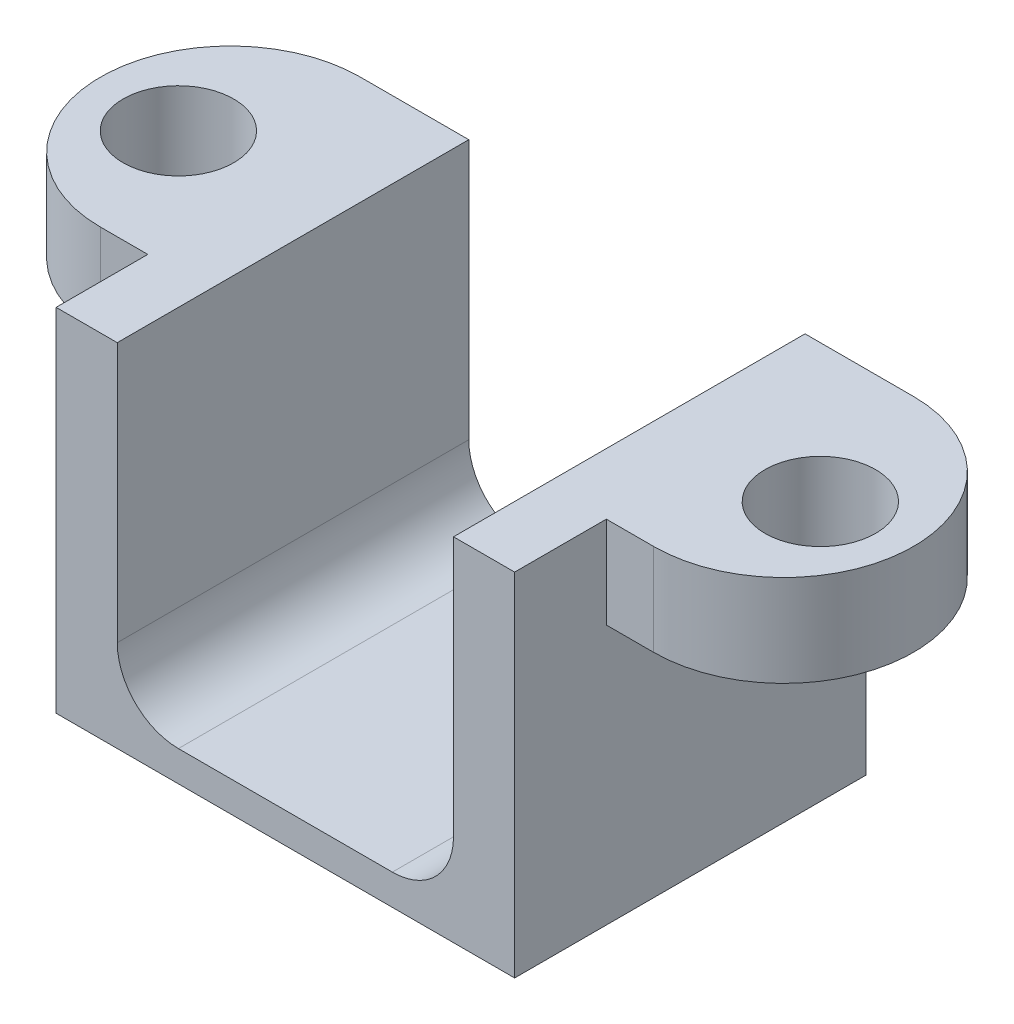
ISO-10303-21;
HEADER;
FILE_DESCRIPTION(('STEP AP214'),'2;1');
FILE_NAME('part.step','',(''),(''),'','','');
FILE_SCHEMA(('AUTOMOTIVE_DESIGN { 1 0 10303 214 1 1 1 1 }'));
ENDSEC;
DATA;
#1=APPLICATION_CONTEXT('core data for automotive mechanical design processes');
#2=APPLICATION_PROTOCOL_DEFINITION('international standard','automotive_design',2000,#1);
#3=PRODUCT_CONTEXT('',#1,'mechanical');
#4=PRODUCT('Part','Part','',(#3));
#5=PRODUCT_RELATED_PRODUCT_CATEGORY('part','',(#4));
#6=PRODUCT_DEFINITION_FORMATION('','',#4);
#7=PRODUCT_DEFINITION_CONTEXT('part definition',#1,'design');
#8=PRODUCT_DEFINITION('design','',#6,#7);
#9=PRODUCT_DEFINITION_SHAPE('','',#8);
#10=(LENGTH_UNIT() NAMED_UNIT(*) SI_UNIT(.MILLI.,.METRE.));
#11=(NAMED_UNIT(*) PLANE_ANGLE_UNIT() SI_UNIT($,.RADIAN.));
#12=(NAMED_UNIT(*) SI_UNIT($,.STERADIAN.) SOLID_ANGLE_UNIT());
#13=UNCERTAINTY_MEASURE_WITH_UNIT(LENGTH_MEASURE(1.E-05),#10,'distance_accuracy_value','');
#14=(GEOMETRIC_REPRESENTATION_CONTEXT(3) GLOBAL_UNCERTAINTY_ASSIGNED_CONTEXT((#13)) GLOBAL_UNIT_ASSIGNED_CONTEXT((#10,
#11,#12)) REPRESENTATION_CONTEXT('',''));
#15=CARTESIAN_POINT('',(0.,0.,0.));
#16=DIRECTION('',(0.,0.,1.));
#17=DIRECTION('',(1.,0.,0.));
#18=AXIS2_PLACEMENT_3D('',#15,#16,#17);
#19=CARTESIAN_POINT('',(0.,0.,11.5));
#20=DIRECTION('',(1.,0.,0.));
#21=DIRECTION('',(0.,0.,-1.));
#22=AXIS2_PLACEMENT_3D('',#19,#20,#21);
#23=PLANE('',#22);
#24=DIRECTION('',(0.,1.,0.));
#25=VECTOR('',#24,1.);
#26=CARTESIAN_POINT('',(0.,8.5,8.5));
#27=LINE('',#26,#25);
#28=CARTESIAN_POINT('',(0.,8.5,8.5));
#29=VERTEX_POINT('',#28);
#30=CARTESIAN_POINT('',(0.,11.5,8.5));
#31=VERTEX_POINT('',#30);
#32=EDGE_CURVE('E201',#29,#31,#27,.T.);
#33=ORIENTED_EDGE('',*,*,#32,.F.);
#34=DIRECTION('',(0.,0.,-1.));
#35=VECTOR('',#34,1.);
#36=CARTESIAN_POINT('',(0.,8.5,0.));
#37=LINE('',#36,#35);
#38=CARTESIAN_POINT('',(0.,8.5,0.));
#39=VERTEX_POINT('',#38);
#40=EDGE_CURVE('E186',#29,#39,#37,.T.);
#41=ORIENTED_EDGE('',*,*,#40,.T.);
#42=DIRECTION('',(0.,-1.,0.));
#43=VECTOR('',#42,1.);
#44=CARTESIAN_POINT('',(0.,0.,0.));
#45=LINE('',#44,#43);
#46=CARTESIAN_POINT('',(0.,0.,0.));
#47=VERTEX_POINT('',#46);
#48=EDGE_CURVE('E226',#39,#47,#45,.T.);
#49=ORIENTED_EDGE('',*,*,#48,.T.);
#50=DIRECTION('',(0.,0.,-1.));
#51=VECTOR('',#50,1.);
#52=CARTESIAN_POINT('',(0.,0.,11.5));
#53=LINE('',#52,#51);
#54=CARTESIAN_POINT('',(0.,0.,11.5));
#55=VERTEX_POINT('',#54);
#56=EDGE_CURVE('E255',#55,#47,#53,.T.);
#57=ORIENTED_EDGE('',*,*,#56,.F.);
#58=DIRECTION('',(0.,-1.,0.));
#59=VECTOR('',#58,1.);
#60=CARTESIAN_POINT('',(0.,0.,11.5));
#61=LINE('',#60,#59);
#62=CARTESIAN_POINT('',(0.,11.5,11.5));
#63=VERTEX_POINT('',#62);
#64=EDGE_CURVE('E229',#63,#55,#61,.T.);
#65=ORIENTED_EDGE('',*,*,#64,.F.);
#66=DIRECTION('',(0.,0.,-1.));
#67=VECTOR('',#66,1.);
#68=CARTESIAN_POINT('',(0.,11.5,11.5));
#69=LINE('',#68,#67);
#70=EDGE_CURVE('E241',#63,#31,#69,.T.);
#71=ORIENTED_EDGE('',*,*,#70,.T.);
#72=EDGE_LOOP('',(#33,#41,#49,#57,#65,#71));
#73=FACE_BOUND('',#72,.T.);
#74=ADVANCED_FACE('F33',(#73),#23,.F.);
#75=CARTESIAN_POINT('',(0.,11.5,11.5));
#76=DIRECTION('',(0.,-1.,0.));
#77=DIRECTION('',(0.,0.,-1.));
#78=AXIS2_PLACEMENT_3D('',#75,#76,#77);
#79=PLANE('',#78);
#80=CARTESIAN_POINT('',(-3.,11.5,4.5));
#81=DIRECTION('',(0.,1.,0.));
#82=DIRECTION('',(0.,0.,1.));
#83=AXIS2_PLACEMENT_3D('',#80,#81,#82);
#84=CIRCLE('',#83,1.80920830863293);
#85=CARTESIAN_POINT('',(-3.,11.5,6.30920830863293));
#86=VERTEX_POINT('',#85);
#87=EDGE_CURVE('E174',#86,#86,#84,.T.);
#88=ORIENTED_EDGE('',*,*,#87,.F.);
#89=EDGE_LOOP('',(#88));
#90=FACE_BOUND('',#89,.T.);
#91=DIRECTION('',(-1.,0.,0.));
#92=VECTOR('',#91,1.);
#93=CARTESIAN_POINT('',(0.,11.5,11.5));
#94=LINE('',#93,#92);
#95=CARTESIAN_POINT('',(2.,11.5,11.5));
#96=VERTEX_POINT('',#95);
#97=EDGE_CURVE('E237',#96,#63,#94,.T.);
#98=ORIENTED_EDGE('',*,*,#97,.F.);
#99=DIRECTION('',(0.,0.,1.));
#100=VECTOR('',#99,1.);
#101=CARTESIAN_POINT('',(2.,11.5,0.));
#102=LINE('',#101,#100);
#103=CARTESIAN_POINT('',(2.,11.5,0.));
#104=VERTEX_POINT('',#103);
#105=EDGE_CURVE('E224',#104,#96,#102,.T.);
#106=ORIENTED_EDGE('',*,*,#105,.F.);
#107=DIRECTION('',(-1.,0.,0.));
#108=VECTOR('',#107,1.);
#109=CARTESIAN_POINT('',(0.,11.5,0.));
#110=LINE('',#109,#108);
#111=CARTESIAN_POINT('',(-1.55,11.5,0.));
#112=VERTEX_POINT('',#111);
#113=EDGE_CURVE('E246',#104,#112,#110,.T.);
#114=ORIENTED_EDGE('',*,*,#113,.T.);
#115=CARTESIAN_POINT('',(-1.55,11.5,4.25));
#116=DIRECTION('',(0.,1.,0.));
#117=DIRECTION('',(0.,0.,1.));
#118=AXIS2_PLACEMENT_3D('',#115,#116,#117);
#119=CIRCLE('',#118,4.25);
#120=CARTESIAN_POINT('',(-1.55,11.5,8.5));
#121=VERTEX_POINT('',#120);
#122=EDGE_CURVE('E184',#112,#121,#119,.T.);
#123=ORIENTED_EDGE('',*,*,#122,.T.);
#124=DIRECTION('',(1.,0.,0.));
#125=VECTOR('',#124,1.);
#126=CARTESIAN_POINT('',(0.,11.5,8.5));
#127=LINE('',#126,#125);
#128=EDGE_CURVE('E188',#121,#31,#127,.T.);
#129=ORIENTED_EDGE('',*,*,#128,.T.);
#130=ORIENTED_EDGE('',*,*,#70,.F.);
#131=EDGE_LOOP('',(#98,#106,#114,#123,#129,#130));
#132=FACE_BOUND('',#131,.T.);
#133=ADVANCED_FACE('F323',(#90,#132),#79,.F.);
#134=CARTESIAN_POINT('',(0.,0.,11.5));
#135=DIRECTION('',(0.,1.,0.));
#136=DIRECTION('',(0.,0.,1.));
#137=AXIS2_PLACEMENT_3D('',#134,#135,#136);
#138=PLANE('',#137);
#139=DIRECTION('',(1.,0.,0.));
#140=VECTOR('',#139,1.);
#141=CARTESIAN_POINT('',(0.,0.,0.));
#142=LINE('',#141,#140);
#143=CARTESIAN_POINT('',(15.,0.,0.));
#144=VERTEX_POINT('',#143);
#145=EDGE_CURVE('E243',#47,#144,#142,.T.);
#146=ORIENTED_EDGE('',*,*,#145,.T.);
#147=DIRECTION('',(0.,0.,-1.));
#148=VECTOR('',#147,1.);
#149=CARTESIAN_POINT('',(15.,0.,11.5));
#150=LINE('',#149,#148);
#151=CARTESIAN_POINT('',(15.,0.,11.5));
#152=VERTEX_POINT('',#151);
#153=EDGE_CURVE('E253',#152,#144,#150,.T.);
#154=ORIENTED_EDGE('',*,*,#153,.F.);
#155=DIRECTION('',(1.,0.,0.));
#156=VECTOR('',#155,1.);
#157=CARTESIAN_POINT('',(0.,0.,11.5));
#158=LINE('',#157,#156);
#159=EDGE_CURVE('E232',#55,#152,#158,.T.);
#160=ORIENTED_EDGE('',*,*,#159,.F.);
#161=ORIENTED_EDGE('',*,*,#56,.T.);
#162=EDGE_LOOP('',(#146,#154,#160,#161));
#163=FACE_BOUND('',#162,.T.);
#164=ADVANCED_FACE('F310',(#163),#138,.F.);
#165=CARTESIAN_POINT('',(15.,0.,11.5));
#166=DIRECTION('',(-1.,0.,0.));
#167=DIRECTION('',(0.,0.,1.));
#168=AXIS2_PLACEMENT_3D('',#165,#166,#167);
#169=PLANE('',#168);
#170=DIRECTION('',(0.,1.,0.));
#171=VECTOR('',#170,1.);
#172=CARTESIAN_POINT('',(15.,0.,0.));
#173=LINE('',#172,#171);
#174=CARTESIAN_POINT('',(15.,8.5,0.));
#175=VERTEX_POINT('',#174);
#176=EDGE_CURVE('E168',#144,#175,#173,.T.);
#177=ORIENTED_EDGE('',*,*,#176,.T.);
#178=DIRECTION('',(0.,0.,1.));
#179=VECTOR('',#178,1.);
#180=CARTESIAN_POINT('',(15.,8.5,0.));
#181=LINE('',#180,#179);
#182=CARTESIAN_POINT('',(15.,8.5,8.5));
#183=VERTEX_POINT('',#182);
#184=EDGE_CURVE('E159',#175,#183,#181,.T.);
#185=ORIENTED_EDGE('',*,*,#184,.T.);
#186=DIRECTION('',(0.,1.,0.));
#187=VECTOR('',#186,1.);
#188=CARTESIAN_POINT('',(15.,8.5,8.5));
#189=LINE('',#188,#187);
#190=CARTESIAN_POINT('',(15.,11.5,8.5));
#191=VERTEX_POINT('',#190);
#192=EDGE_CURVE('E144',#183,#191,#189,.T.);
#193=ORIENTED_EDGE('',*,*,#192,.T.);
#194=DIRECTION('',(0.,0.,-1.));
#195=VECTOR('',#194,1.);
#196=CARTESIAN_POINT('',(15.,11.5,11.5));
#197=LINE('',#196,#195);
#198=CARTESIAN_POINT('',(15.,11.5,11.5));
#199=VERTEX_POINT('',#198);
#200=EDGE_CURVE('E251',#199,#191,#197,.T.);
#201=ORIENTED_EDGE('',*,*,#200,.F.);
#202=DIRECTION('',(0.,1.,0.));
#203=VECTOR('',#202,1.);
#204=CARTESIAN_POINT('',(15.,0.,11.5));
#205=LINE('',#204,#203);
#206=EDGE_CURVE('E235',#152,#199,#205,.T.);
#207=ORIENTED_EDGE('',*,*,#206,.F.);
#208=ORIENTED_EDGE('',*,*,#153,.T.);
#209=EDGE_LOOP('',(#177,#185,#193,#201,#207,#208));
#210=FACE_BOUND('',#209,.T.);
#211=ADVANCED_FACE('F165',(#210),#169,.F.);
#212=CARTESIAN_POINT('',(18.,11.5,4.5));
#213=DIRECTION('',(0.,-1.,0.));
#214=DIRECTION('',(0.,0.,1.));
#215=AXIS2_PLACEMENT_3D('',#212,#213,#214);
#216=CIRCLE('',#215,1.80920830863293);
#217=CARTESIAN_POINT('',(18.,11.5,6.30920830863293));
#218=VERTEX_POINT('',#217);
#219=EDGE_CURVE('E347',#218,#218,#216,.T.);
#220=ORIENTED_EDGE('',*,*,#219,.T.);
#221=EDGE_LOOP('',(#220));
#222=FACE_BOUND('',#221,.T.);
#223=CARTESIAN_POINT('',(16.55,11.5,0.));
#224=VERTEX_POINT('',#223);
#225=CARTESIAN_POINT('',(13.,11.5,0.));
#226=VERTEX_POINT('',#225);
#227=EDGE_CURVE('E233',#224,#226,#110,.T.);
#228=ORIENTED_EDGE('',*,*,#227,.T.);
#229=DIRECTION('',(0.,0.,1.));
#230=VECTOR('',#229,1.);
#231=CARTESIAN_POINT('',(13.,11.5,0.));
#232=LINE('',#231,#230);
#233=CARTESIAN_POINT('',(13.,11.5,11.5));
#234=VERTEX_POINT('',#233);
#235=EDGE_CURVE('E217',#226,#234,#232,.T.);
#236=ORIENTED_EDGE('',*,*,#235,.T.);
#237=EDGE_CURVE('E238',#199,#234,#94,.T.);
#238=ORIENTED_EDGE('',*,*,#237,.F.);
#239=ORIENTED_EDGE('',*,*,#200,.T.);
#240=DIRECTION('',(1.,0.,0.));
#241=VECTOR('',#240,1.);
#242=CARTESIAN_POINT('',(15.,11.5,8.5));
#243=LINE('',#242,#241);
#244=CARTESIAN_POINT('',(16.55,11.5,8.5));
#245=VERTEX_POINT('',#244);
#246=EDGE_CURVE('E48',#191,#245,#243,.T.);
#247=ORIENTED_EDGE('',*,*,#246,.T.);
#248=CARTESIAN_POINT('',(16.55,11.5,4.25));
#249=DIRECTION('',(0.,1.,0.));
#250=DIRECTION('',(0.,0.,-1.));
#251=AXIS2_PLACEMENT_3D('',#248,#249,#250);
#252=CIRCLE('',#251,4.25);
#253=EDGE_CURVE('E169',#245,#224,#252,.T.);
#254=ORIENTED_EDGE('',*,*,#253,.T.);
#255=EDGE_LOOP('',(#228,#236,#238,#239,#247,#254));
#256=FACE_BOUND('',#255,.T.);
#257=ADVANCED_FACE('F301',(#222,#256),#79,.F.);
#258=CARTESIAN_POINT('',(0.,0.,11.5));
#259=DIRECTION('',(0.,0.,-1.));
#260=DIRECTION('',(-1.,0.,0.));
#261=AXIS2_PLACEMENT_3D('',#258,#259,#260);
#262=PLANE('',#261);
#263=DIRECTION('',(1.,0.,0.));
#264=VECTOR('',#263,1.);
#265=CARTESIAN_POINT('',(2.,0.999999999999999,11.5));
#266=LINE('',#265,#264);
#267=CARTESIAN_POINT('',(4.,0.999999999999999,11.5));
#268=VERTEX_POINT('',#267);
#269=CARTESIAN_POINT('',(11.,0.999999999999999,11.5));
#270=VERTEX_POINT('',#269);
#271=EDGE_CURVE('E220',#268,#270,#266,.T.);
#272=ORIENTED_EDGE('',*,*,#271,.F.);
#273=CARTESIAN_POINT('',(4.,3.,11.5));
#274=DIRECTION('',(0.,0.,-1.));
#275=DIRECTION('',(-1.,0.,0.));
#276=AXIS2_PLACEMENT_3D('',#273,#274,#275);
#277=CIRCLE('',#276,2.);
#278=CARTESIAN_POINT('',(2.,3.,11.5));
#279=VERTEX_POINT('',#278);
#280=EDGE_CURVE('E41',#268,#279,#277,.T.);
#281=ORIENTED_EDGE('',*,*,#280,.T.);
#282=DIRECTION('',(0.,-1.,0.));
#283=VECTOR('',#282,1.);
#284=CARTESIAN_POINT('',(2.,11.5,11.5));
#285=LINE('',#284,#283);
#286=EDGE_CURVE('E203',#96,#279,#285,.T.);
#287=ORIENTED_EDGE('',*,*,#286,.F.);
#288=ORIENTED_EDGE('',*,*,#97,.T.);
#289=ORIENTED_EDGE('',*,*,#64,.T.);
#290=ORIENTED_EDGE('',*,*,#159,.T.);
#291=ORIENTED_EDGE('',*,*,#206,.T.);
#292=ORIENTED_EDGE('',*,*,#237,.T.);
#293=DIRECTION('',(0.,1.,0.));
#294=VECTOR('',#293,1.);
#295=CARTESIAN_POINT('',(13.,11.5,11.5));
#296=LINE('',#295,#294);
#297=CARTESIAN_POINT('',(13.,3.,11.5));
#298=VERTEX_POINT('',#297);
#299=EDGE_CURVE('E212',#298,#234,#296,.T.);
#300=ORIENTED_EDGE('',*,*,#299,.F.);
#301=CARTESIAN_POINT('',(11.,3.,11.5));
#302=DIRECTION('',(0.,0.,-1.));
#303=DIRECTION('',(-1.,0.,0.));
#304=AXIS2_PLACEMENT_3D('',#301,#302,#303);
#305=CIRCLE('',#304,2.);
#306=EDGE_CURVE('E268',#298,#270,#305,.T.);
#307=ORIENTED_EDGE('',*,*,#306,.T.);
#308=EDGE_LOOP('',(#272,#281,#287,#288,#289,#290,#291,#292,#300,#307));
#309=FACE_BOUND('',#308,.T.);
#310=ADVANCED_FACE('F274',(#309),#262,.F.);
#311=CARTESIAN_POINT('',(0.,0.,0.));
#312=DIRECTION('',(0.,0.,-1.));
#313=DIRECTION('',(-1.,0.,0.));
#314=AXIS2_PLACEMENT_3D('',#311,#312,#313);
#315=PLANE('',#314);
#316=DIRECTION('',(0.,-1.,0.));
#317=VECTOR('',#316,1.);
#318=CARTESIAN_POINT('',(2.,11.5,0.));
#319=LINE('',#318,#317);
#320=CARTESIAN_POINT('',(2.,3.,0.));
#321=VERTEX_POINT('',#320);
#322=EDGE_CURVE('E208',#104,#321,#319,.T.);
#323=ORIENTED_EDGE('',*,*,#322,.T.);
#324=CARTESIAN_POINT('',(4.,3.,0.));
#325=DIRECTION('',(0.,0.,-1.));
#326=DIRECTION('',(-1.,0.,0.));
#327=AXIS2_PLACEMENT_3D('',#324,#325,#326);
#328=CIRCLE('',#327,2.);
#329=CARTESIAN_POINT('',(4.,0.999999999999999,0.));
#330=VERTEX_POINT('',#329);
#331=EDGE_CURVE('E11',#321,#330,#328,.F.);
#332=ORIENTED_EDGE('',*,*,#331,.T.);
#333=DIRECTION('',(1.,0.,0.));
#334=VECTOR('',#333,1.);
#335=CARTESIAN_POINT('',(2.,0.999999999999999,0.));
#336=LINE('',#335,#334);
#337=CARTESIAN_POINT('',(11.,0.999999999999999,0.));
#338=VERTEX_POINT('',#337);
#339=EDGE_CURVE('E211',#330,#338,#336,.T.);
#340=ORIENTED_EDGE('',*,*,#339,.T.);
#341=CARTESIAN_POINT('',(11.,3.,0.));
#342=DIRECTION('',(0.,0.,-1.));
#343=DIRECTION('',(-1.,0.,0.));
#344=AXIS2_PLACEMENT_3D('',#341,#342,#343);
#345=CIRCLE('',#344,2.);
#346=CARTESIAN_POINT('',(13.,3.,0.));
#347=VERTEX_POINT('',#346);
#348=EDGE_CURVE('E270',#338,#347,#345,.F.);
#349=ORIENTED_EDGE('',*,*,#348,.T.);
#350=DIRECTION('',(0.,1.,0.));
#351=VECTOR('',#350,1.);
#352=CARTESIAN_POINT('',(13.,11.5,0.));
#353=LINE('',#352,#351);
#354=EDGE_CURVE('E215',#347,#226,#353,.T.);
#355=ORIENTED_EDGE('',*,*,#354,.T.);
#356=ORIENTED_EDGE('',*,*,#227,.F.);
#357=DIRECTION('',(0.,1.,0.));
#358=VECTOR('',#357,1.);
#359=CARTESIAN_POINT('',(16.55,8.5,0.));
#360=LINE('',#359,#358);
#361=CARTESIAN_POINT('',(16.55,8.5,0.));
#362=VERTEX_POINT('',#361);
#363=EDGE_CURVE('E181',#362,#224,#360,.T.);
#364=ORIENTED_EDGE('',*,*,#363,.F.);
#365=DIRECTION('',(-1.,0.,0.));
#366=VECTOR('',#365,1.);
#367=CARTESIAN_POINT('',(15.,8.5,0.));
#368=LINE('',#367,#366);
#369=EDGE_CURVE('E153',#362,#175,#368,.T.);
#370=ORIENTED_EDGE('',*,*,#369,.T.);
#371=ORIENTED_EDGE('',*,*,#176,.F.);
#372=ORIENTED_EDGE('',*,*,#145,.F.);
#373=ORIENTED_EDGE('',*,*,#48,.F.);
#374=DIRECTION('',(-1.,0.,0.));
#375=VECTOR('',#374,1.);
#376=CARTESIAN_POINT('',(0.,8.5,0.));
#377=LINE('',#376,#375);
#378=CARTESIAN_POINT('',(-1.55,8.5,0.));
#379=VERTEX_POINT('',#378);
#380=EDGE_CURVE('E56',#39,#379,#377,.T.);
#381=ORIENTED_EDGE('',*,*,#380,.T.);
#382=DIRECTION('',(0.,1.,0.));
#383=VECTOR('',#382,1.);
#384=CARTESIAN_POINT('',(-1.55,8.5,0.));
#385=LINE('',#384,#383);
#386=EDGE_CURVE('E196',#379,#112,#385,.T.);
#387=ORIENTED_EDGE('',*,*,#386,.T.);
#388=ORIENTED_EDGE('',*,*,#113,.F.);
#389=EDGE_LOOP('',(#323,#332,#340,#349,#355,#356,#364,#370,#371,#372,#373,#381,#387,#388));
#390=FACE_BOUND('',#389,.T.);
#391=ADVANCED_FACE('F285',(#390),#315,.T.);
#392=CARTESIAN_POINT('',(2.,11.5,0.));
#393=DIRECTION('',(-1.,0.,0.));
#394=DIRECTION('',(0.,-1.,0.));
#395=AXIS2_PLACEMENT_3D('',#392,#393,#394);
#396=PLANE('',#395);
#397=ORIENTED_EDGE('',*,*,#286,.T.);
#398=DIRECTION('',(0.,0.,1.));
#399=VECTOR('',#398,1.);
#400=CARTESIAN_POINT('',(2.,3.,0.));
#401=LINE('',#400,#399);
#402=EDGE_CURVE('E266',#279,#321,#401,.F.);
#403=ORIENTED_EDGE('',*,*,#402,.T.);
#404=ORIENTED_EDGE('',*,*,#322,.F.);
#405=ORIENTED_EDGE('',*,*,#105,.T.);
#406=EDGE_LOOP('',(#397,#403,#404,#405));
#407=FACE_BOUND('',#406,.T.);
#408=ADVANCED_FACE('F280',(#407),#396,.F.);
#409=CARTESIAN_POINT('',(13.,11.5,0.));
#410=DIRECTION('',(1.,0.,0.));
#411=DIRECTION('',(0.,1.,0.));
#412=AXIS2_PLACEMENT_3D('',#409,#410,#411);
#413=PLANE('',#412);
#414=ORIENTED_EDGE('',*,*,#354,.F.);
#415=DIRECTION('',(0.,0.,1.));
#416=VECTOR('',#415,1.);
#417=CARTESIAN_POINT('',(13.,3.,11.5));
#418=LINE('',#417,#416);
#419=EDGE_CURVE('E258',#347,#298,#418,.T.);
#420=ORIENTED_EDGE('',*,*,#419,.T.);
#421=ORIENTED_EDGE('',*,*,#299,.T.);
#422=ORIENTED_EDGE('',*,*,#235,.F.);
#423=EDGE_LOOP('',(#414,#420,#421,#422));
#424=FACE_BOUND('',#423,.T.);
#425=ADVANCED_FACE('F297',(#424),#413,.F.);
#426=CARTESIAN_POINT('',(2.,0.999999999999999,0.));
#427=DIRECTION('',(0.,-1.,0.));
#428=DIRECTION('',(0.,0.,-1.));
#429=AXIS2_PLACEMENT_3D('',#426,#427,#428);
#430=PLANE('',#429);
#431=ORIENTED_EDGE('',*,*,#271,.T.);
#432=DIRECTION('',(0.,0.,1.));
#433=VECTOR('',#432,1.);
#434=CARTESIAN_POINT('',(11.,0.999999999999999,0.));
#435=LINE('',#434,#433);
#436=EDGE_CURVE('E264',#270,#338,#435,.F.);
#437=ORIENTED_EDGE('',*,*,#436,.T.);
#438=ORIENTED_EDGE('',*,*,#339,.F.);
#439=DIRECTION('',(0.,0.,1.));
#440=VECTOR('',#439,1.);
#441=CARTESIAN_POINT('',(4.,0.999999999999999,11.5));
#442=LINE('',#441,#440);
#443=EDGE_CURVE('E261',#330,#268,#442,.T.);
#444=ORIENTED_EDGE('',*,*,#443,.T.);
#445=EDGE_LOOP('',(#431,#437,#438,#444));
#446=FACE_BOUND('',#445,.T.);
#447=ADVANCED_FACE('F289',(#446),#430,.F.);
#448=CARTESIAN_POINT('',(11.,3.,0.));
#449=DIRECTION('',(0.,0.,-1.));
#450=DIRECTION('',(-1.,0.,0.));
#451=AXIS2_PLACEMENT_3D('',#448,#449,#450);
#452=CYLINDRICAL_SURFACE('',#451,2.);
#453=ORIENTED_EDGE('',*,*,#348,.F.);
#454=ORIENTED_EDGE('',*,*,#436,.F.);
#455=ORIENTED_EDGE('',*,*,#306,.F.);
#456=ORIENTED_EDGE('',*,*,#419,.F.);
#457=EDGE_LOOP('',(#453,#454,#455,#456));
#458=FACE_BOUND('',#457,.T.);
#459=ADVANCED_FACE('F292',(#458),#452,.F.);
#460=CARTESIAN_POINT('',(4.,3.,0.));
#461=DIRECTION('',(0.,0.,-1.));
#462=DIRECTION('',(-1.,0.,0.));
#463=AXIS2_PLACEMENT_3D('',#460,#461,#462);
#464=CYLINDRICAL_SURFACE('',#463,2.);
#465=ORIENTED_EDGE('',*,*,#331,.F.);
#466=ORIENTED_EDGE('',*,*,#402,.F.);
#467=ORIENTED_EDGE('',*,*,#280,.F.);
#468=ORIENTED_EDGE('',*,*,#443,.F.);
#469=EDGE_LOOP('',(#465,#466,#467,#468));
#470=FACE_BOUND('',#469,.T.);
#471=ADVANCED_FACE('F35',(#470),#464,.F.);
#472=CARTESIAN_POINT('',(0.,8.5,8.5));
#473=DIRECTION('',(0.,0.,1.));
#474=DIRECTION('',(1.,0.,0.));
#475=AXIS2_PLACEMENT_3D('',#472,#473,#474);
#476=PLANE('',#475);
#477=ORIENTED_EDGE('',*,*,#128,.F.);
#478=DIRECTION('',(0.,1.,0.));
#479=VECTOR('',#478,1.);
#480=CARTESIAN_POINT('',(-1.55,8.5,8.5));
#481=LINE('',#480,#479);
#482=CARTESIAN_POINT('',(-1.55,8.5,8.5));
#483=VERTEX_POINT('',#482);
#484=EDGE_CURVE('E204',#483,#121,#481,.T.);
#485=ORIENTED_EDGE('',*,*,#484,.F.);
#486=DIRECTION('',(1.,0.,0.));
#487=VECTOR('',#486,1.);
#488=CARTESIAN_POINT('',(0.,8.5,8.5));
#489=LINE('',#488,#487);
#490=EDGE_CURVE('E193',#483,#29,#489,.T.);
#491=ORIENTED_EDGE('',*,*,#490,.T.);
#492=ORIENTED_EDGE('',*,*,#32,.T.);
#493=EDGE_LOOP('',(#477,#485,#491,#492));
#494=FACE_BOUND('',#493,.T.);
#495=ADVANCED_FACE('F318',(#494),#476,.T.);
#496=CARTESIAN_POINT('',(-1.55,8.5,4.25));
#497=DIRECTION('',(0.,1.,0.));
#498=DIRECTION('',(0.,0.,1.));
#499=AXIS2_PLACEMENT_3D('',#496,#497,#498);
#500=CYLINDRICAL_SURFACE('',#499,4.25);
#501=ORIENTED_EDGE('',*,*,#122,.F.);
#502=ORIENTED_EDGE('',*,*,#386,.F.);
#503=CARTESIAN_POINT('',(-1.55,8.5,4.25));
#504=DIRECTION('',(0.,1.,0.));
#505=DIRECTION('',(0.,0.,1.));
#506=AXIS2_PLACEMENT_3D('',#503,#504,#505);
#507=CIRCLE('',#506,4.25);
#508=EDGE_CURVE('E190',#379,#483,#507,.T.);
#509=ORIENTED_EDGE('',*,*,#508,.T.);
#510=ORIENTED_EDGE('',*,*,#484,.T.);
#511=EDGE_LOOP('',(#501,#502,#509,#510));
#512=FACE_BOUND('',#511,.T.);
#513=ADVANCED_FACE('F321',(#512),#500,.T.);
#514=CARTESIAN_POINT('',(-1.55,8.5,4.25));
#515=DIRECTION('',(0.,1.,0.));
#516=DIRECTION('',(0.,0.,1.));
#517=AXIS2_PLACEMENT_3D('',#514,#515,#516);
#518=PLANE('',#517);
#519=CARTESIAN_POINT('',(-3.,8.5,4.5));
#520=DIRECTION('',(0.,1.,0.));
#521=DIRECTION('',(0.,0.,1.));
#522=AXIS2_PLACEMENT_3D('',#519,#520,#521);
#523=CIRCLE('',#522,1.80920830863293);
#524=CARTESIAN_POINT('',(-3.,8.5,6.30920830863293));
#525=VERTEX_POINT('',#524);
#526=EDGE_CURVE('E179',#525,#525,#523,.T.);
#527=ORIENTED_EDGE('',*,*,#526,.T.);
#528=EDGE_LOOP('',(#527));
#529=FACE_BOUND('',#528,.T.);
#530=ORIENTED_EDGE('',*,*,#40,.F.);
#531=ORIENTED_EDGE('',*,*,#490,.F.);
#532=ORIENTED_EDGE('',*,*,#508,.F.);
#533=ORIENTED_EDGE('',*,*,#380,.F.);
#534=EDGE_LOOP('',(#530,#531,#532,#533));
#535=FACE_BOUND('',#534,.T.);
#536=ADVANCED_FACE('F315',(#529,#535),#518,.F.);
#537=CARTESIAN_POINT('',(16.55,8.5,4.25));
#538=DIRECTION('',(0.,1.,0.));
#539=DIRECTION('',(0.,0.,1.));
#540=AXIS2_PLACEMENT_3D('',#537,#538,#539);
#541=CYLINDRICAL_SURFACE('',#540,4.25);
#542=ORIENTED_EDGE('',*,*,#253,.F.);
#543=DIRECTION('',(0.,1.,0.));
#544=VECTOR('',#543,1.);
#545=CARTESIAN_POINT('',(16.55,8.5,8.5));
#546=LINE('',#545,#544);
#547=CARTESIAN_POINT('',(16.55,8.5,8.5));
#548=VERTEX_POINT('',#547);
#549=EDGE_CURVE('E152',#548,#245,#546,.T.);
#550=ORIENTED_EDGE('',*,*,#549,.F.);
#551=CARTESIAN_POINT('',(16.55,8.5,4.25));
#552=DIRECTION('',(0.,1.,0.));
#553=DIRECTION('',(0.,0.,-1.));
#554=AXIS2_PLACEMENT_3D('',#551,#552,#553);
#555=CIRCLE('',#554,4.25);
#556=EDGE_CURVE('E162',#548,#362,#555,.T.);
#557=ORIENTED_EDGE('',*,*,#556,.T.);
#558=ORIENTED_EDGE('',*,*,#363,.T.);
#559=EDGE_LOOP('',(#542,#550,#557,#558));
#560=FACE_BOUND('',#559,.T.);
#561=ADVANCED_FACE('F304',(#560),#541,.T.);
#562=CARTESIAN_POINT('',(15.,8.5,8.5));
#563=DIRECTION('',(0.,0.,1.));
#564=DIRECTION('',(1.,0.,0.));
#565=AXIS2_PLACEMENT_3D('',#562,#563,#564);
#566=PLANE('',#565);
#567=ORIENTED_EDGE('',*,*,#246,.F.);
#568=ORIENTED_EDGE('',*,*,#192,.F.);
#569=DIRECTION('',(1.,0.,0.));
#570=VECTOR('',#569,1.);
#571=CARTESIAN_POINT('',(15.,8.5,8.5));
#572=LINE('',#571,#570);
#573=EDGE_CURVE('E147',#183,#548,#572,.T.);
#574=ORIENTED_EDGE('',*,*,#573,.T.);
#575=ORIENTED_EDGE('',*,*,#549,.T.);
#576=EDGE_LOOP('',(#567,#568,#574,#575));
#577=FACE_BOUND('',#576,.T.);
#578=ADVANCED_FACE('F146',(#577),#566,.T.);
#579=CARTESIAN_POINT('',(16.55,8.5,4.25));
#580=DIRECTION('',(0.,-1.,0.));
#581=DIRECTION('',(0.,0.,-1.));
#582=AXIS2_PLACEMENT_3D('',#579,#580,#581);
#583=PLANE('',#582);
#584=CARTESIAN_POINT('',(18.,8.5,4.5));
#585=DIRECTION('',(0.,-1.,0.));
#586=DIRECTION('',(0.,0.,1.));
#587=AXIS2_PLACEMENT_3D('',#584,#585,#586);
#588=CIRCLE('',#587,1.80920830863293);
#589=CARTESIAN_POINT('',(18.,8.5,6.30920830863293));
#590=VERTEX_POINT('',#589);
#591=EDGE_CURVE('E349',#590,#590,#588,.T.);
#592=ORIENTED_EDGE('',*,*,#591,.F.);
#593=EDGE_LOOP('',(#592));
#594=FACE_BOUND('',#593,.T.);
#595=ORIENTED_EDGE('',*,*,#184,.F.);
#596=ORIENTED_EDGE('',*,*,#369,.F.);
#597=ORIENTED_EDGE('',*,*,#556,.F.);
#598=ORIENTED_EDGE('',*,*,#573,.F.);
#599=EDGE_LOOP('',(#595,#596,#597,#598));
#600=FACE_BOUND('',#599,.T.);
#601=ADVANCED_FACE('F157',(#594,#600),#583,.T.);
#602=CARTESIAN_POINT('',(-3.,8.5,4.5));
#603=DIRECTION('',(0.,1.,0.));
#604=DIRECTION('',(0.,0.,1.));
#605=AXIS2_PLACEMENT_3D('',#602,#603,#604);
#606=CYLINDRICAL_SURFACE('',#605,1.80920830863293);
#607=ORIENTED_EDGE('',*,*,#526,.F.);
#608=EDGE_LOOP('',(#607));
#609=FACE_BOUND('',#608,.T.);
#610=ORIENTED_EDGE('',*,*,#87,.T.);
#611=EDGE_LOOP('',(#610));
#612=FACE_BOUND('',#611,.T.);
#613=ADVANCED_FACE('F358',(#609,#612),#606,.F.);
#614=CARTESIAN_POINT('',(18.,8.5,4.5));
#615=DIRECTION('',(0.,1.,0.));
#616=DIRECTION('',(-1.,0.,0.));
#617=AXIS2_PLACEMENT_3D('',#614,#615,#616);
#618=CYLINDRICAL_SURFACE('',#617,1.80920830863293);
#619=ORIENTED_EDGE('',*,*,#591,.T.);
#620=EDGE_LOOP('',(#619));
#621=FACE_BOUND('',#620,.T.);
#622=ORIENTED_EDGE('',*,*,#219,.F.);
#623=EDGE_LOOP('',(#622));
#624=FACE_BOUND('',#623,.T.);
#625=ADVANCED_FACE('F360',(#621,#624),#618,.F.);
#626=CLOSED_SHELL('',(#74,#133,#164,#211,#257,#310,#391,#408,#425,#447,#459,#471,#495,#513,#536,
#561,#578,#601,#613,#625));
#627=MANIFOLD_SOLID_BREP('B2',#626);
#628=ADVANCED_BREP_SHAPE_REPRESENTATION('',(#18,#627),#14);
#629=SHAPE_DEFINITION_REPRESENTATION(#9,#628);
ENDSEC;
END-ISO-10303-21;
